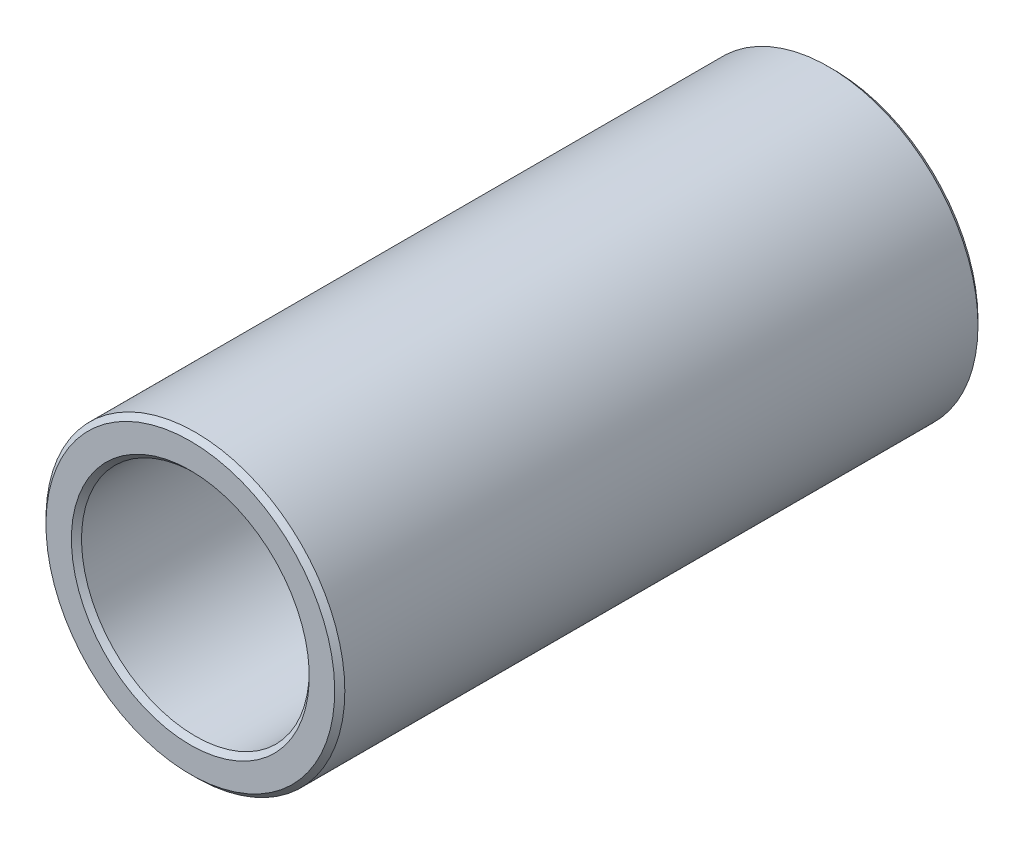
ISO-10303-21;
HEADER;
FILE_DESCRIPTION(('STEP AP214'),'2;1');
FILE_NAME('part.step','',(''),(''),'','','');
FILE_SCHEMA(('AUTOMOTIVE_DESIGN { 1 0 10303 214 1 1 1 1 }'));
ENDSEC;
DATA;
#1=APPLICATION_CONTEXT('core data for automotive mechanical design processes');
#2=APPLICATION_PROTOCOL_DEFINITION('international standard','automotive_design',2000,#1);
#3=PRODUCT_CONTEXT('',#1,'mechanical');
#4=PRODUCT('Part','Part','',(#3));
#5=PRODUCT_RELATED_PRODUCT_CATEGORY('part','',(#4));
#6=PRODUCT_DEFINITION_FORMATION('','',#4);
#7=PRODUCT_DEFINITION_CONTEXT('part definition',#1,'design');
#8=PRODUCT_DEFINITION('design','',#6,#7);
#9=PRODUCT_DEFINITION_SHAPE('','',#8);
#10=(LENGTH_UNIT() NAMED_UNIT(*) SI_UNIT(.MILLI.,.METRE.));
#11=(NAMED_UNIT(*) PLANE_ANGLE_UNIT() SI_UNIT($,.RADIAN.));
#12=(NAMED_UNIT(*) SI_UNIT($,.STERADIAN.) SOLID_ANGLE_UNIT());
#13=UNCERTAINTY_MEASURE_WITH_UNIT(LENGTH_MEASURE(1.E-05),#10,'distance_accuracy_value','');
#14=(GEOMETRIC_REPRESENTATION_CONTEXT(3) GLOBAL_UNCERTAINTY_ASSIGNED_CONTEXT((#13)) GLOBAL_UNIT_ASSIGNED_CONTEXT((#10,
#11,#12)) REPRESENTATION_CONTEXT('',''));
#15=CARTESIAN_POINT('',(0.,0.,0.));
#16=DIRECTION('',(0.,0.,1.));
#17=DIRECTION('',(1.,0.,0.));
#18=AXIS2_PLACEMENT_3D('',#15,#16,#17);
#19=CARTESIAN_POINT('',(0.,0.,7.37616));
#20=DIRECTION('',(0.,0.,1.));
#21=DIRECTION('',(1.,0.,0.));
#22=AXIS2_PLACEMENT_3D('',#19,#20,#21);
#23=CYLINDRICAL_SURFACE('',#22,2.2479);
#24=CARTESIAN_POINT('',(0.,0.,6.25000000002274));
#25=DIRECTION('',(0.,0.,1.));
#26=DIRECTION('',(1.,0.,0.));
#27=AXIS2_PLACEMENT_3D('',#24,#25,#26);
#28=CIRCLE('',#27,2.24790000004305);
#29=CARTESIAN_POINT('',(2.24790000004305,0.,6.25000000002274));
#30=VERTEX_POINT('',#29);
#31=EDGE_CURVE('E30',#30,#30,#28,.T.);
#32=ORIENTED_EDGE('',*,*,#31,.T.);
#33=EDGE_LOOP('',(#32));
#34=FACE_BOUND('',#33,.T.);
#35=CARTESIAN_POINT('',(0.,0.,-6.24999999996589));
#36=DIRECTION('',(0.,0.,-1.));
#37=DIRECTION('',(-1.,0.,0.));
#38=AXIS2_PLACEMENT_3D('',#35,#36,#37);
#39=CIRCLE('',#38,2.2478999999862);
#40=CARTESIAN_POINT('',(-2.2478999999862,0.,-6.24999999996589));
#41=VERTEX_POINT('',#40);
#42=EDGE_CURVE('E33',#41,#41,#39,.T.);
#43=ORIENTED_EDGE('',*,*,#42,.T.);
#44=EDGE_LOOP('',(#43));
#45=FACE_BOUND('',#44,.T.);
#46=ADVANCED_FACE('F15',(#34,#45),#23,.F.);
#47=CARTESIAN_POINT('',(0.,0.,-6.34999999994079));
#48=DIRECTION('',(0.,0.,-1.));
#49=DIRECTION('',(-1.,0.,0.));
#50=AXIS2_PLACEMENT_3D('',#47,#48,#49);
#51=CONICAL_SURFACE('',#50,2.34789999990426,0.785398163397448);
#52=CARTESIAN_POINT('',(0.,0.,-6.34999999999764));
#53=DIRECTION('',(0.,0.,-1.));
#54=DIRECTION('',(-1.,0.,0.));
#55=AXIS2_PLACEMENT_3D('',#52,#53,#54);
#56=CIRCLE('',#55,2.3478999999611);
#57=CARTESIAN_POINT('',(-2.3478999999611,0.,-6.34999999999764));
#58=VERTEX_POINT('',#57);
#59=EDGE_CURVE('E18',#58,#58,#56,.T.);
#60=ORIENTED_EDGE('',*,*,#59,.T.);
#61=EDGE_LOOP('',(#60));
#62=FACE_BOUND('',#61,.T.);
#63=ORIENTED_EDGE('',*,*,#42,.F.);
#64=EDGE_LOOP('',(#63));
#65=FACE_BOUND('',#64,.T.);
#66=ADVANCED_FACE('F47',(#62,#65),#51,.F.);
#67=CARTESIAN_POINT('',(0.,0.,6.34999999988395));
#68=DIRECTION('',(0.,0.,1.));
#69=DIRECTION('',(0.,-1.,0.));
#70=AXIS2_PLACEMENT_3D('',#67,#68,#69);
#71=CONICAL_SURFACE('',#70,2.34789999990426,0.785398163397448);
#72=CARTESIAN_POINT('',(0.,0.,6.34999999994079));
#73=DIRECTION('',(0.,0.,1.));
#74=DIRECTION('',(0.,-1.,0.));
#75=AXIS2_PLACEMENT_3D('',#72,#73,#74);
#76=CIRCLE('',#75,2.3478999999611);
#77=CARTESIAN_POINT('',(0.,-2.3478999999611,6.34999999994079));
#78=VERTEX_POINT('',#77);
#79=EDGE_CURVE('E40',#78,#78,#76,.T.);
#80=ORIENTED_EDGE('',*,*,#79,.T.);
#81=EDGE_LOOP('',(#80));
#82=FACE_BOUND('',#81,.T.);
#83=ORIENTED_EDGE('',*,*,#31,.F.);
#84=EDGE_LOOP('',(#83));
#85=FACE_BOUND('',#84,.T.);
#86=ADVANCED_FACE('F53',(#82,#85),#71,.F.);
#87=CARTESIAN_POINT('',(0.,2.95,-6.35));
#88=DIRECTION('',(0.,0.,1.));
#89=DIRECTION('',(1.,0.,0.));
#90=AXIS2_PLACEMENT_3D('',#87,#88,#89);
#91=PLANE('',#90);
#92=CARTESIAN_POINT('',(0.,0.,-6.35000000005448));
#93=DIRECTION('',(0.,0.,1.));
#94=DIRECTION('',(1.,0.,0.));
#95=AXIS2_PLACEMENT_3D('',#92,#93,#94);
#96=CIRCLE('',#95,2.84999999996671);
#97=CARTESIAN_POINT('',(2.84999999996671,0.,-6.35000000005448));
#98=VERTEX_POINT('',#97);
#99=EDGE_CURVE('E38',#98,#98,#96,.T.);
#100=ORIENTED_EDGE('',*,*,#99,.F.);
#101=EDGE_LOOP('',(#100));
#102=FACE_BOUND('',#101,.T.);
#103=ORIENTED_EDGE('',*,*,#59,.F.);
#104=EDGE_LOOP('',(#103));
#105=FACE_BOUND('',#104,.T.);
#106=ADVANCED_FACE('F50',(#102,#105),#91,.F.);
#107=CARTESIAN_POINT('',(0.,2.95,6.35));
#108=DIRECTION('',(0.,0.,-1.));
#109=DIRECTION('',(-1.,0.,0.));
#110=AXIS2_PLACEMENT_3D('',#107,#108,#109);
#111=PLANE('',#110);
#112=CARTESIAN_POINT('',(0.,0.,6.34999999999764));
#113=DIRECTION('',(0.,0.,-1.));
#114=DIRECTION('',(0.,1.,0.));
#115=AXIS2_PLACEMENT_3D('',#112,#113,#114);
#116=CIRCLE('',#115,2.8500000000804);
#117=CARTESIAN_POINT('',(0.,2.8500000000804,6.34999999999764));
#118=VERTEX_POINT('',#117);
#119=EDGE_CURVE('E27',#118,#118,#116,.T.);
#120=ORIENTED_EDGE('',*,*,#119,.F.);
#121=EDGE_LOOP('',(#120));
#122=FACE_BOUND('',#121,.T.);
#123=ORIENTED_EDGE('',*,*,#79,.F.);
#124=EDGE_LOOP('',(#123));
#125=FACE_BOUND('',#124,.T.);
#126=ADVANCED_FACE('F52',(#122,#125),#111,.F.);
#127=CARTESIAN_POINT('',(0.,0.,-6.25000000002274));
#128=DIRECTION('',(0.,0.,1.));
#129=DIRECTION('',(1.,0.,0.));
#130=AXIS2_PLACEMENT_3D('',#127,#128,#129);
#131=CONICAL_SURFACE('',#130,2.94999999999845,0.785398163397448);
#132=CARTESIAN_POINT('',(0.,0.,-6.25));
#133=DIRECTION('',(0.,0.,1.));
#134=DIRECTION('',(1.,0.,0.));
#135=AXIS2_PLACEMENT_3D('',#132,#133,#134);
#136=CIRCLE('',#135,2.95);
#137=CARTESIAN_POINT('',(2.95,0.,-6.25));
#138=VERTEX_POINT('',#137);
#139=EDGE_CURVE('E22',#138,#138,#136,.T.);
#140=ORIENTED_EDGE('',*,*,#139,.F.);
#141=EDGE_LOOP('',(#140));
#142=FACE_BOUND('',#141,.T.);
#143=ORIENTED_EDGE('',*,*,#99,.T.);
#144=EDGE_LOOP('',(#143));
#145=FACE_BOUND('',#144,.T.);
#146=ADVANCED_FACE('F61',(#142,#145),#131,.T.);
#147=CARTESIAN_POINT('',(0.,0.,6.25000000013642));
#148=DIRECTION('',(0.,0.,-1.));
#149=DIRECTION('',(0.,1.,0.));
#150=AXIS2_PLACEMENT_3D('',#147,#148,#149);
#151=CONICAL_SURFACE('',#150,2.94999999988477,0.785398163113231);
#152=CARTESIAN_POINT('',(0.,0.,6.25));
#153=DIRECTION('',(0.,0.,1.));
#154=DIRECTION('',(1.,0.,0.));
#155=AXIS2_PLACEMENT_3D('',#152,#153,#154);
#156=CIRCLE('',#155,2.95);
#157=CARTESIAN_POINT('',(2.95,0.,6.25));
#158=VERTEX_POINT('',#157);
#159=EDGE_CURVE('E10',#158,#158,#156,.F.);
#160=ORIENTED_EDGE('',*,*,#159,.F.);
#161=EDGE_LOOP('',(#160));
#162=FACE_BOUND('',#161,.T.);
#163=ORIENTED_EDGE('',*,*,#119,.T.);
#164=EDGE_LOOP('',(#163));
#165=FACE_BOUND('',#164,.T.);
#166=ADVANCED_FACE('F68',(#162,#165),#151,.T.);
#167=CARTESIAN_POINT('',(0.,0.,7.37616));
#168=DIRECTION('',(0.,0.,1.));
#169=DIRECTION('',(1.,0.,0.));
#170=AXIS2_PLACEMENT_3D('',#167,#168,#169);
#171=CYLINDRICAL_SURFACE('',#170,2.95);
#172=ORIENTED_EDGE('',*,*,#159,.T.);
#173=EDGE_LOOP('',(#172));
#174=FACE_BOUND('',#173,.T.);
#175=ORIENTED_EDGE('',*,*,#139,.T.);
#176=EDGE_LOOP('',(#175));
#177=FACE_BOUND('',#176,.T.);
#178=ADVANCED_FACE('F66',(#174,#177),#171,.T.);
#179=CLOSED_SHELL('',(#46,#66,#86,#106,#126,#146,#166,#178));
#180=MANIFOLD_SOLID_BREP('B1',#179);
#181=ADVANCED_BREP_SHAPE_REPRESENTATION('',(#18,#180),#14);
#182=SHAPE_DEFINITION_REPRESENTATION(#9,#181);
ENDSEC;
END-ISO-10303-21;
